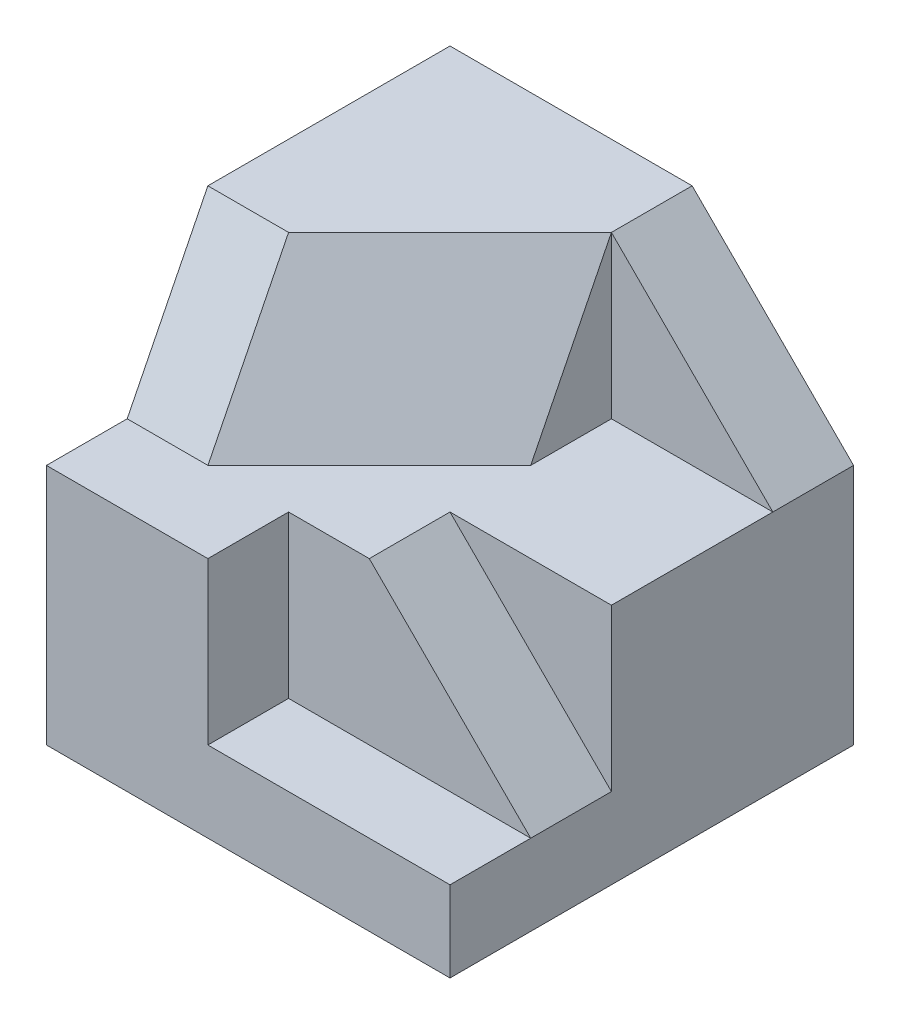
ISO-10303-21;
HEADER;
FILE_DESCRIPTION(('STEP AP214'),'2;1');
FILE_NAME('part.step','',(''),(''),'','','');
FILE_SCHEMA(('AUTOMOTIVE_DESIGN { 1 0 10303 214 1 1 1 1 }'));
ENDSEC;
DATA;
#1=APPLICATION_CONTEXT('core data for automotive mechanical design processes');
#2=APPLICATION_PROTOCOL_DEFINITION('international standard','automotive_design',2000,#1);
#3=PRODUCT_CONTEXT('',#1,'mechanical');
#4=PRODUCT('Part','Part','',(#3));
#5=PRODUCT_RELATED_PRODUCT_CATEGORY('part','',(#4));
#6=PRODUCT_DEFINITION_FORMATION('','',#4);
#7=PRODUCT_DEFINITION_CONTEXT('part definition',#1,'design');
#8=PRODUCT_DEFINITION('design','',#6,#7);
#9=PRODUCT_DEFINITION_SHAPE('','',#8);
#10=(LENGTH_UNIT() NAMED_UNIT(*) SI_UNIT(.MILLI.,.METRE.));
#11=(NAMED_UNIT(*) PLANE_ANGLE_UNIT() SI_UNIT($,.RADIAN.));
#12=(NAMED_UNIT(*) SI_UNIT($,.STERADIAN.) SOLID_ANGLE_UNIT());
#13=UNCERTAINTY_MEASURE_WITH_UNIT(LENGTH_MEASURE(1.E-05),#10,'distance_accuracy_value','');
#14=(GEOMETRIC_REPRESENTATION_CONTEXT(3) GLOBAL_UNCERTAINTY_ASSIGNED_CONTEXT((#13)) GLOBAL_UNIT_ASSIGNED_CONTEXT((#10,
#11,#12)) REPRESENTATION_CONTEXT('',''));
#15=CARTESIAN_POINT('',(0.,0.,0.));
#16=DIRECTION('',(0.,0.,1.));
#17=DIRECTION('',(1.,0.,0.));
#18=AXIS2_PLACEMENT_3D('',#15,#16,#17);
#19=CARTESIAN_POINT('',(-2.5,2.5,3.));
#20=DIRECTION('',(0.,-0.447036349590366,-0.89451579200421));
#21=DIRECTION('',(0.,0.89451579200421,-0.447036349590367));
#22=AXIS2_PLACEMENT_3D('',#19,#20,#21);
#23=PLANE('',#22);
#24=DIRECTION('',(-0.408197700208268,-0.816597698810937,0.408096601114692));
#25=VECTOR('',#24,1.);
#26=CARTESIAN_POINT('',(-0.833457179510442,1.83341597243937,3.33312691965817));
#27=LINE('',#26,#25);
#28=CARTESIAN_POINT('',(-1.49950490153612,0.500990442293238,3.9990096803895));
#29=VERTEX_POINT('',#28);
#30=CARTESIAN_POINT('',(-1.5,0.5,3.99950465623141));
#31=VERTEX_POINT('',#30);
#32=EDGE_CURVE('E124',#29,#31,#27,.T.);
#33=ORIENTED_EDGE('',*,*,#32,.F.);
#34=DIRECTION('',(-0.000221546406301295,0.894515770051536,-0.447036338619466));
#35=VECTOR('',#34,1.);
#36=CARTESIAN_POINT('',(-1.50000004908281,2.50019817675423,2.99990096070569));
#37=LINE('',#36,#35);
#38=CARTESIAN_POINT('',(-1.5,2.5,3.));
#39=VERTEX_POINT('',#38);
#40=EDGE_CURVE('E130',#29,#39,#37,.T.);
#41=ORIENTED_EDGE('',*,*,#40,.T.);
#42=DIRECTION('',(1.,0.,0.));
#43=VECTOR('',#42,1.);
#44=CARTESIAN_POINT('',(-2.5,2.5,3.));
#45=LINE('',#44,#43);
#46=CARTESIAN_POINT('',(-2.5,2.5,3.));
#47=VERTEX_POINT('',#46);
#48=EDGE_CURVE('E162',#47,#39,#45,.T.);
#49=ORIENTED_EDGE('',*,*,#48,.F.);
#50=DIRECTION('',(0.,0.89451579200421,-0.447036349590367));
#51=VECTOR('',#50,1.);
#52=CARTESIAN_POINT('',(-2.5,2.5,3.));
#53=LINE('',#52,#51);
#54=CARTESIAN_POINT('',(-2.5,0.5,3.99950465623141));
#55=VERTEX_POINT('',#54);
#56=EDGE_CURVE('E142',#55,#47,#53,.T.);
#57=ORIENTED_EDGE('',*,*,#56,.F.);
#58=DIRECTION('',(-1.,0.,0.));
#59=VECTOR('',#58,1.);
#60=CARTESIAN_POINT('',(-0.499999999999999,0.5,3.99950465623141));
#61=LINE('',#60,#59);
#62=EDGE_CURVE('E135',#31,#55,#61,.T.);
#63=ORIENTED_EDGE('',*,*,#62,.F.);
#64=EDGE_LOOP('',(#33,#41,#49,#57,#63));
#65=FACE_BOUND('',#64,.T.);
#66=ADVANCED_FACE('F33',(#65),#23,.F.);
#67=CARTESIAN_POINT('',(1.22222222222222,0.611111111111111,1.22222222222222));
#68=DIRECTION('',(-0.666666666666666,-0.333333333333333,-0.666666666666667));
#69=DIRECTION('',(-0.707106781186548,0.,0.707106781186547));
#70=AXIS2_PLACEMENT_3D('',#67,#68,#69);
#71=PLANE('',#70);
#72=DIRECTION('',(-0.707194308451179,0.000350304293873403,0.707019156304241));
#73=VECTOR('',#72,1.);
#74=CARTESIAN_POINT('',(1.25006181825718,0.499628461552267,1.25012395096668));
#75=LINE('',#74,#73);
#76=CARTESIAN_POINT('',(0.500000000000001,0.499999999999999,2.));
#77=VERTEX_POINT('',#76);
#78=EDGE_CURVE('E126',#77,#29,#75,.T.);
#79=ORIENTED_EDGE('',*,*,#78,.F.);
#80=DIRECTION('',(0.,0.894427190999916,-0.447213595499958));
#81=VECTOR('',#80,1.);
#82=CARTESIAN_POINT('',(0.500000000000001,0.499999999999999,2.));
#83=LINE('',#82,#81);
#84=CARTESIAN_POINT('',(0.500000000000001,2.5,1.));
#85=VERTEX_POINT('',#84);
#86=EDGE_CURVE('E37',#77,#85,#83,.T.);
#87=ORIENTED_EDGE('',*,*,#86,.T.);
#88=DIRECTION('',(-0.707106781186548,0.,0.707106781186547));
#89=VECTOR('',#88,1.);
#90=CARTESIAN_POINT('',(0.500000000000001,2.5,1.));
#91=LINE('',#90,#89);
#92=EDGE_CURVE('E11',#85,#39,#91,.T.);
#93=ORIENTED_EDGE('',*,*,#92,.T.);
#94=ORIENTED_EDGE('',*,*,#40,.F.);
#95=EDGE_LOOP('',(#79,#87,#93,#94));
#96=FACE_BOUND('',#95,.T.);
#97=ADVANCED_FACE('F239',(#96),#71,.F.);
#98=CARTESIAN_POINT('',(0.,0.5,0.));
#99=DIRECTION('',(0.,1.,0.));
#100=DIRECTION('',(0.,0.,1.));
#101=AXIS2_PLACEMENT_3D('',#98,#99,#100);
#102=PLANE('',#101);
#103=DIRECTION('',(0.,0.,1.));
#104=VECTOR('',#103,1.);
#105=CARTESIAN_POINT('',(0.500000000000001,0.5,1.));
#106=LINE('',#105,#104);
#107=CARTESIAN_POINT('',(0.500000000000001,0.5,1.));
#108=VERTEX_POINT('',#107);
#109=EDGE_CURVE('E139',#108,#77,#106,.T.);
#110=ORIENTED_EDGE('',*,*,#109,.T.);
#111=DIRECTION('',(-0.707194351842185,0.,0.707019199684501));
#112=VECTOR('',#111,1.);
#113=CARTESIAN_POINT('',(0.500000000000001,0.5,2.));
#114=LINE('',#113,#112);
#115=EDGE_CURVE('E49',#77,#31,#114,.T.);
#116=ORIENTED_EDGE('',*,*,#115,.T.);
#117=ORIENTED_EDGE('',*,*,#62,.T.);
#118=DIRECTION('',(0.,0.,1.));
#119=VECTOR('',#118,1.);
#120=CARTESIAN_POINT('',(-2.5,0.5,5.));
#121=LINE('',#120,#119);
#122=CARTESIAN_POINT('',(-2.5,0.5,5.));
#123=VERTEX_POINT('',#122);
#124=EDGE_CURVE('E144',#55,#123,#121,.T.);
#125=ORIENTED_EDGE('',*,*,#124,.T.);
#126=DIRECTION('',(1.,0.,0.));
#127=VECTOR('',#126,1.);
#128=CARTESIAN_POINT('',(-2.5,0.5,5.));
#129=LINE('',#128,#127);
#130=CARTESIAN_POINT('',(-0.5,0.5,5.));
#131=VERTEX_POINT('',#130);
#132=EDGE_CURVE('E147',#123,#131,#129,.T.);
#133=ORIENTED_EDGE('',*,*,#132,.T.);
#134=DIRECTION('',(0.,0.,1.));
#135=VECTOR('',#134,1.);
#136=CARTESIAN_POINT('',(-0.5,0.5,4.));
#137=LINE('',#136,#135);
#138=CARTESIAN_POINT('',(-0.5,0.5,4.));
#139=VERTEX_POINT('',#138);
#140=EDGE_CURVE('E181',#139,#131,#137,.T.);
#141=ORIENTED_EDGE('',*,*,#140,.F.);
#142=DIRECTION('',(-1.,0.,0.));
#143=VECTOR('',#142,1.);
#144=CARTESIAN_POINT('',(2.5,0.5,4.));
#145=LINE('',#144,#143);
#146=CARTESIAN_POINT('',(0.500000000000002,0.5,4.));
#147=VERTEX_POINT('',#146);
#148=EDGE_CURVE('E183',#147,#139,#145,.T.);
#149=ORIENTED_EDGE('',*,*,#148,.F.);
#150=DIRECTION('',(0.,0.,1.));
#151=VECTOR('',#150,1.);
#152=CARTESIAN_POINT('',(0.500000000000001,0.5,3.));
#153=LINE('',#152,#151);
#154=CARTESIAN_POINT('',(0.500000000000001,0.5,3.));
#155=VERTEX_POINT('',#154);
#156=EDGE_CURVE('E203',#155,#147,#153,.T.);
#157=ORIENTED_EDGE('',*,*,#156,.F.);
#158=DIRECTION('',(-1.,0.,0.));
#159=VECTOR('',#158,1.);
#160=CARTESIAN_POINT('',(2.5,0.5,3.));
#161=LINE('',#160,#159);
#162=CARTESIAN_POINT('',(2.5,0.5,3.));
#163=VERTEX_POINT('',#162);
#164=EDGE_CURVE('E213',#163,#155,#161,.T.);
#165=ORIENTED_EDGE('',*,*,#164,.F.);
#166=DIRECTION('',(0.,0.,-1.));
#167=VECTOR('',#166,1.);
#168=CARTESIAN_POINT('',(2.5,0.5,5.));
#169=LINE('',#168,#167);
#170=CARTESIAN_POINT('',(2.5,0.5,1.));
#171=VERTEX_POINT('',#170);
#172=EDGE_CURVE('E154',#163,#171,#169,.T.);
#173=ORIENTED_EDGE('',*,*,#172,.T.);
#174=DIRECTION('',(-1.,0.,0.));
#175=VECTOR('',#174,1.);
#176=CARTESIAN_POINT('',(2.5,0.5,1.));
#177=LINE('',#176,#175);
#178=EDGE_CURVE('E155',#171,#108,#177,.T.);
#179=ORIENTED_EDGE('',*,*,#178,.T.);
#180=EDGE_LOOP('',(#110,#116,#117,#125,#133,#141,#149,#157,#165,#173,#179));
#181=FACE_BOUND('',#180,.T.);
#182=ADVANCED_FACE('F134',(#181),#102,.T.);
#183=CARTESIAN_POINT('',(0.,0.,5.));
#184=DIRECTION('',(0.,0.,1.));
#185=DIRECTION('',(1.,0.,0.));
#186=AXIS2_PLACEMENT_3D('',#183,#184,#185);
#187=PLANE('',#186);
#188=DIRECTION('',(1.,0.,0.));
#189=VECTOR('',#188,1.);
#190=CARTESIAN_POINT('',(-0.499999999999999,-1.5,5.));
#191=LINE('',#190,#189);
#192=CARTESIAN_POINT('',(-0.499999999999999,-1.5,5.));
#193=VERTEX_POINT('',#192);
#194=CARTESIAN_POINT('',(2.5,-1.5,5.));
#195=VERTEX_POINT('',#194);
#196=EDGE_CURVE('E180',#193,#195,#191,.T.);
#197=ORIENTED_EDGE('',*,*,#196,.F.);
#198=DIRECTION('',(0.,-1.,0.));
#199=VECTOR('',#198,1.);
#200=CARTESIAN_POINT('',(-0.5,0.5,5.));
#201=LINE('',#200,#199);
#202=EDGE_CURVE('E184',#131,#193,#201,.T.);
#203=ORIENTED_EDGE('',*,*,#202,.F.);
#204=ORIENTED_EDGE('',*,*,#132,.F.);
#205=DIRECTION('',(0.,-1.,0.));
#206=VECTOR('',#205,1.);
#207=CARTESIAN_POINT('',(-2.5,-2.5,5.));
#208=LINE('',#207,#206);
#209=CARTESIAN_POINT('',(-2.5,-2.5,5.));
#210=VERTEX_POINT('',#209);
#211=EDGE_CURVE('E157',#123,#210,#208,.T.);
#212=ORIENTED_EDGE('',*,*,#211,.T.);
#213=DIRECTION('',(1.,0.,0.));
#214=VECTOR('',#213,1.);
#215=CARTESIAN_POINT('',(2.5,-2.5,5.));
#216=LINE('',#215,#214);
#217=CARTESIAN_POINT('',(2.5,-2.5,5.));
#218=VERTEX_POINT('',#217);
#219=EDGE_CURVE('E261',#210,#218,#216,.T.);
#220=ORIENTED_EDGE('',*,*,#219,.T.);
#221=DIRECTION('',(0.,1.,0.));
#222=VECTOR('',#221,1.);
#223=CARTESIAN_POINT('',(2.5,-2.5,5.));
#224=LINE('',#223,#222);
#225=EDGE_CURVE('E169',#218,#195,#224,.T.);
#226=ORIENTED_EDGE('',*,*,#225,.T.);
#227=EDGE_LOOP('',(#197,#203,#204,#212,#220,#226));
#228=FACE_BOUND('',#227,.T.);
#229=ADVANCED_FACE('F268',(#228),#187,.T.);
#230=CARTESIAN_POINT('',(-2.5,-2.5,5.));
#231=DIRECTION('',(1.,0.,0.));
#232=DIRECTION('',(0.,0.,-1.));
#233=AXIS2_PLACEMENT_3D('',#230,#231,#232);
#234=PLANE('',#233);
#235=ORIENTED_EDGE('',*,*,#124,.F.);
#236=ORIENTED_EDGE('',*,*,#56,.T.);
#237=DIRECTION('',(0.,0.,-1.));
#238=VECTOR('',#237,1.);
#239=CARTESIAN_POINT('',(-2.5,2.5,5.));
#240=LINE('',#239,#238);
#241=CARTESIAN_POINT('',(-2.5,2.5,0.));
#242=VERTEX_POINT('',#241);
#243=EDGE_CURVE('E168',#47,#242,#240,.T.);
#244=ORIENTED_EDGE('',*,*,#243,.T.);
#245=DIRECTION('',(0.,-1.,0.));
#246=VECTOR('',#245,1.);
#247=CARTESIAN_POINT('',(-2.5,-2.5,0.));
#248=LINE('',#247,#246);
#249=CARTESIAN_POINT('',(-2.5,-2.5,0.));
#250=VERTEX_POINT('',#249);
#251=EDGE_CURVE('E249',#242,#250,#248,.T.);
#252=ORIENTED_EDGE('',*,*,#251,.T.);
#253=DIRECTION('',(0.,0.,-1.));
#254=VECTOR('',#253,1.);
#255=CARTESIAN_POINT('',(-2.5,-2.5,5.));
#256=LINE('',#255,#254);
#257=EDGE_CURVE('E208',#210,#250,#256,.T.);
#258=ORIENTED_EDGE('',*,*,#257,.F.);
#259=ORIENTED_EDGE('',*,*,#211,.F.);
#260=EDGE_LOOP('',(#235,#236,#244,#252,#258,#259));
#261=FACE_BOUND('',#260,.T.);
#262=ADVANCED_FACE('F277',(#261),#234,.F.);
#263=CARTESIAN_POINT('',(2.5,-2.5,5.));
#264=DIRECTION('',(0.,1.,0.));
#265=DIRECTION('',(-1.,0.,0.));
#266=AXIS2_PLACEMENT_3D('',#263,#264,#265);
#267=PLANE('',#266);
#268=DIRECTION('',(1.,0.,0.));
#269=VECTOR('',#268,1.);
#270=CARTESIAN_POINT('',(2.5,-2.5,0.));
#271=LINE('',#270,#269);
#272=CARTESIAN_POINT('',(2.5,-2.5,0.));
#273=VERTEX_POINT('',#272);
#274=EDGE_CURVE('E256',#250,#273,#271,.T.);
#275=ORIENTED_EDGE('',*,*,#274,.T.);
#276=DIRECTION('',(0.,0.,-1.));
#277=VECTOR('',#276,1.);
#278=CARTESIAN_POINT('',(2.5,-2.5,5.));
#279=LINE('',#278,#277);
#280=EDGE_CURVE('E190',#218,#273,#279,.T.);
#281=ORIENTED_EDGE('',*,*,#280,.F.);
#282=ORIENTED_EDGE('',*,*,#219,.F.);
#283=ORIENTED_EDGE('',*,*,#257,.T.);
#284=EDGE_LOOP('',(#275,#281,#282,#283));
#285=FACE_BOUND('',#284,.T.);
#286=ADVANCED_FACE('F275',(#285),#267,.F.);
#287=CARTESIAN_POINT('',(2.5,-2.5,5.));
#288=DIRECTION('',(-1.,0.,0.));
#289=DIRECTION('',(0.,0.,1.));
#290=AXIS2_PLACEMENT_3D('',#287,#288,#289);
#291=PLANE('',#290);
#292=DIRECTION('',(0.,1.,0.));
#293=VECTOR('',#292,1.);
#294=CARTESIAN_POINT('',(2.5,-1.5,3.));
#295=LINE('',#294,#293);
#296=CARTESIAN_POINT('',(2.5,-1.5,3.));
#297=VERTEX_POINT('',#296);
#298=EDGE_CURVE('E205',#297,#163,#295,.T.);
#299=ORIENTED_EDGE('',*,*,#298,.F.);
#300=DIRECTION('',(0.,0.,1.));
#301=VECTOR('',#300,1.);
#302=CARTESIAN_POINT('',(2.5,-1.5,3.));
#303=LINE('',#302,#301);
#304=CARTESIAN_POINT('',(2.5,-1.5,4.));
#305=VERTEX_POINT('',#304);
#306=EDGE_CURVE('E191',#297,#305,#303,.T.);
#307=ORIENTED_EDGE('',*,*,#306,.T.);
#308=DIRECTION('',(0.,0.,1.));
#309=VECTOR('',#308,1.);
#310=CARTESIAN_POINT('',(2.5,-1.5,4.));
#311=LINE('',#310,#309);
#312=EDGE_CURVE('E187',#305,#195,#311,.T.);
#313=ORIENTED_EDGE('',*,*,#312,.T.);
#314=ORIENTED_EDGE('',*,*,#225,.F.);
#315=ORIENTED_EDGE('',*,*,#280,.T.);
#316=DIRECTION('',(0.,1.,0.));
#317=VECTOR('',#316,1.);
#318=CARTESIAN_POINT('',(2.5,-2.5,0.));
#319=LINE('',#318,#317);
#320=CARTESIAN_POINT('',(2.5,0.5,0.));
#321=VERTEX_POINT('',#320);
#322=EDGE_CURVE('E177',#273,#321,#319,.T.);
#323=ORIENTED_EDGE('',*,*,#322,.T.);
#324=DIRECTION('',(0.,0.,1.));
#325=VECTOR('',#324,1.);
#326=CARTESIAN_POINT('',(2.5,0.5,-1.));
#327=LINE('',#326,#325);
#328=EDGE_CURVE('E166',#321,#171,#327,.T.);
#329=ORIENTED_EDGE('',*,*,#328,.T.);
#330=ORIENTED_EDGE('',*,*,#172,.F.);
#331=EDGE_LOOP('',(#299,#307,#313,#314,#315,#323,#329,#330));
#332=FACE_BOUND('',#331,.T.);
#333=ADVANCED_FACE('F224',(#332),#291,.F.);
#334=CARTESIAN_POINT('',(2.5,2.5,5.));
#335=DIRECTION('',(0.,-1.,0.));
#336=DIRECTION('',(0.,0.,-1.));
#337=AXIS2_PLACEMENT_3D('',#334,#335,#336);
#338=PLANE('',#337);
#339=ORIENTED_EDGE('',*,*,#48,.T.);
#340=ORIENTED_EDGE('',*,*,#92,.F.);
#341=DIRECTION('',(0.,0.,1.));
#342=VECTOR('',#341,1.);
#343=CARTESIAN_POINT('',(0.500000000000001,2.5,-1.));
#344=LINE('',#343,#342);
#345=CARTESIAN_POINT('',(0.500000000000001,2.5,0.));
#346=VERTEX_POINT('',#345);
#347=EDGE_CURVE('E161',#346,#85,#344,.T.);
#348=ORIENTED_EDGE('',*,*,#347,.F.);
#349=DIRECTION('',(-1.,0.,0.));
#350=VECTOR('',#349,1.);
#351=CARTESIAN_POINT('',(2.5,2.5,0.));
#352=LINE('',#351,#350);
#353=EDGE_CURVE('E165',#346,#242,#352,.T.);
#354=ORIENTED_EDGE('',*,*,#353,.T.);
#355=ORIENTED_EDGE('',*,*,#243,.F.);
#356=EDGE_LOOP('',(#339,#340,#348,#354,#355));
#357=FACE_BOUND('',#356,.T.);
#358=ADVANCED_FACE('F35',(#357),#338,.F.);
#359=CARTESIAN_POINT('',(0.,0.,0.));
#360=DIRECTION('',(0.,0.,1.));
#361=DIRECTION('',(1.,0.,0.));
#362=AXIS2_PLACEMENT_3D('',#359,#360,#361);
#363=PLANE('',#362);
#364=ORIENTED_EDGE('',*,*,#353,.F.);
#365=DIRECTION('',(0.707106781186548,-0.707106781186548,0.));
#366=VECTOR('',#365,1.);
#367=CARTESIAN_POINT('',(1.5,1.5,0.));
#368=LINE('',#367,#366);
#369=EDGE_CURVE('E150',#346,#321,#368,.T.);
#370=ORIENTED_EDGE('',*,*,#369,.T.);
#371=ORIENTED_EDGE('',*,*,#322,.F.);
#372=ORIENTED_EDGE('',*,*,#274,.F.);
#373=ORIENTED_EDGE('',*,*,#251,.F.);
#374=EDGE_LOOP('',(#364,#370,#371,#372,#373));
#375=FACE_BOUND('',#374,.T.);
#376=ADVANCED_FACE('F246',(#375),#363,.F.);
#377=CARTESIAN_POINT('',(0.500000000000001,0.5,1.));
#378=DIRECTION('',(-1.,0.,0.));
#379=DIRECTION('',(0.,0.,1.));
#380=AXIS2_PLACEMENT_3D('',#377,#378,#379);
#381=PLANE('',#380);
#382=DIRECTION('',(0.,1.,0.));
#383=VECTOR('',#382,1.);
#384=CARTESIAN_POINT('',(0.500000000000001,0.5,1.));
#385=LINE('',#384,#383);
#386=EDGE_CURVE('E145',#108,#85,#385,.T.);
#387=ORIENTED_EDGE('',*,*,#386,.T.);
#388=ORIENTED_EDGE('',*,*,#86,.F.);
#389=ORIENTED_EDGE('',*,*,#109,.F.);
#390=EDGE_LOOP('',(#387,#388,#389));
#391=FACE_BOUND('',#390,.T.);
#392=ADVANCED_FACE('F235',(#391),#381,.F.);
#393=CARTESIAN_POINT('',(2.5,0.5,1.));
#394=DIRECTION('',(0.,0.,-1.));
#395=DIRECTION('',(-1.,0.,0.));
#396=AXIS2_PLACEMENT_3D('',#393,#394,#395);
#397=PLANE('',#396);
#398=ORIENTED_EDGE('',*,*,#178,.F.);
#399=DIRECTION('',(0.707106781186548,-0.707106781186548,0.));
#400=VECTOR('',#399,1.);
#401=CARTESIAN_POINT('',(0.500000000000001,2.5,1.));
#402=LINE('',#401,#400);
#403=EDGE_CURVE('E174',#85,#171,#402,.T.);
#404=ORIENTED_EDGE('',*,*,#403,.F.);
#405=ORIENTED_EDGE('',*,*,#386,.F.);
#406=EDGE_LOOP('',(#398,#404,#405));
#407=FACE_BOUND('',#406,.T.);
#408=ADVANCED_FACE('F232',(#407),#397,.F.);
#409=CARTESIAN_POINT('',(0.500000000000001,2.5,-1.));
#410=DIRECTION('',(-0.707106781186547,-0.707106781186547,0.));
#411=DIRECTION('',(0.707106781186548,-0.707106781186548,0.));
#412=AXIS2_PLACEMENT_3D('',#409,#410,#411);
#413=PLANE('',#412);
#414=ORIENTED_EDGE('',*,*,#347,.T.);
#415=ORIENTED_EDGE('',*,*,#403,.T.);
#416=ORIENTED_EDGE('',*,*,#328,.F.);
#417=ORIENTED_EDGE('',*,*,#369,.F.);
#418=EDGE_LOOP('',(#414,#415,#416,#417));
#419=FACE_BOUND('',#418,.T.);
#420=ADVANCED_FACE('F244',(#419),#413,.F.);
#421=CARTESIAN_POINT('',(-0.499999999999999,-1.5,4.));
#422=DIRECTION('',(0.,-1.,0.));
#423=DIRECTION('',(0.,0.,-1.));
#424=AXIS2_PLACEMENT_3D('',#421,#422,#423);
#425=PLANE('',#424);
#426=ORIENTED_EDGE('',*,*,#196,.T.);
#427=ORIENTED_EDGE('',*,*,#312,.F.);
#428=DIRECTION('',(1.,0.,0.));
#429=VECTOR('',#428,1.);
#430=CARTESIAN_POINT('',(-0.499999999999999,-1.5,4.));
#431=LINE('',#430,#429);
#432=CARTESIAN_POINT('',(-0.499999999999999,-1.5,4.));
#433=VERTEX_POINT('',#432);
#434=EDGE_CURVE('E195',#433,#305,#431,.T.);
#435=ORIENTED_EDGE('',*,*,#434,.F.);
#436=DIRECTION('',(0.,0.,1.));
#437=VECTOR('',#436,1.);
#438=CARTESIAN_POINT('',(-0.499999999999999,-1.5,4.));
#439=LINE('',#438,#437);
#440=EDGE_CURVE('E185',#433,#193,#439,.T.);
#441=ORIENTED_EDGE('',*,*,#440,.T.);
#442=EDGE_LOOP('',(#426,#427,#435,#441));
#443=FACE_BOUND('',#442,.T.);
#444=ADVANCED_FACE('F282',(#443),#425,.F.);
#445=CARTESIAN_POINT('',(-0.5,0.5,4.));
#446=DIRECTION('',(-1.,0.,0.));
#447=DIRECTION('',(0.,-1.,0.));
#448=AXIS2_PLACEMENT_3D('',#445,#446,#447);
#449=PLANE('',#448);
#450=ORIENTED_EDGE('',*,*,#202,.T.);
#451=ORIENTED_EDGE('',*,*,#440,.F.);
#452=DIRECTION('',(0.,-1.,0.));
#453=VECTOR('',#452,1.);
#454=CARTESIAN_POINT('',(-0.5,0.5,4.));
#455=LINE('',#454,#453);
#456=EDGE_CURVE('E199',#139,#433,#455,.T.);
#457=ORIENTED_EDGE('',*,*,#456,.F.);
#458=ORIENTED_EDGE('',*,*,#140,.T.);
#459=EDGE_LOOP('',(#450,#451,#457,#458));
#460=FACE_BOUND('',#459,.T.);
#461=ADVANCED_FACE('F286',(#460),#449,.F.);
#462=CARTESIAN_POINT('',(0.,0.,4.));
#463=DIRECTION('',(0.,0.,1.));
#464=DIRECTION('',(1.,0.,0.));
#465=AXIS2_PLACEMENT_3D('',#462,#463,#464);
#466=PLANE('',#465);
#467=DIRECTION('',(0.707106781186548,-0.707106781186548,0.));
#468=VECTOR('',#467,1.);
#469=CARTESIAN_POINT('',(0.500000000000001,0.5,4.));
#470=LINE('',#469,#468);
#471=EDGE_CURVE('E198',#147,#305,#470,.T.);
#472=ORIENTED_EDGE('',*,*,#471,.F.);
#473=ORIENTED_EDGE('',*,*,#148,.T.);
#474=ORIENTED_EDGE('',*,*,#456,.T.);
#475=ORIENTED_EDGE('',*,*,#434,.T.);
#476=EDGE_LOOP('',(#472,#473,#474,#475));
#477=FACE_BOUND('',#476,.T.);
#478=ADVANCED_FACE('F290',(#477),#466,.T.);
#479=CARTESIAN_POINT('',(0.500000000000001,0.5,3.));
#480=DIRECTION('',(-0.707106781186547,-0.707106781186547,0.));
#481=DIRECTION('',(0.707106781186548,-0.707106781186548,0.));
#482=AXIS2_PLACEMENT_3D('',#479,#480,#481);
#483=PLANE('',#482);
#484=ORIENTED_EDGE('',*,*,#471,.T.);
#485=ORIENTED_EDGE('',*,*,#306,.F.);
#486=DIRECTION('',(0.707106781186548,-0.707106781186548,0.));
#487=VECTOR('',#486,1.);
#488=CARTESIAN_POINT('',(0.500000000000001,0.5,3.));
#489=LINE('',#488,#487);
#490=EDGE_CURVE('E210',#155,#297,#489,.T.);
#491=ORIENTED_EDGE('',*,*,#490,.F.);
#492=ORIENTED_EDGE('',*,*,#156,.T.);
#493=EDGE_LOOP('',(#484,#485,#491,#492));
#494=FACE_BOUND('',#493,.T.);
#495=ADVANCED_FACE('F292',(#494),#483,.F.);
#496=CARTESIAN_POINT('',(0.,0.,3.));
#497=DIRECTION('',(0.,0.,1.));
#498=DIRECTION('',(1.,0.,0.));
#499=AXIS2_PLACEMENT_3D('',#496,#497,#498);
#500=PLANE('',#499);
#501=ORIENTED_EDGE('',*,*,#298,.T.);
#502=ORIENTED_EDGE('',*,*,#164,.T.);
#503=ORIENTED_EDGE('',*,*,#490,.T.);
#504=EDGE_LOOP('',(#501,#502,#503));
#505=FACE_BOUND('',#504,.T.);
#506=ADVANCED_FACE('F218',(#505),#500,.T.);
#507=CARTESIAN_POINT('',(0.500000000000001,2.5,2.));
#508=DIRECTION('',(0.707019199684501,0.,0.707194351842185));
#509=DIRECTION('',(0.707194351842185,0.,-0.707019199684501));
#510=AXIS2_PLACEMENT_3D('',#507,#508,#509);
#511=PLANE('',#510);
#512=ORIENTED_EDGE('',*,*,#32,.T.);
#513=ORIENTED_EDGE('',*,*,#115,.F.);
#514=ORIENTED_EDGE('',*,*,#78,.T.);
#515=EDGE_LOOP('',(#512,#513,#514));
#516=FACE_BOUND('',#515,.T.);
#517=ADVANCED_FACE('F125',(#516),#511,.T.);
#518=CLOSED_SHELL('',(#66,#97,#182,#229,#262,#286,#333,#358,#376,#392,#408,#420,#444,#461,#478,
#495,#506,#517));
#519=MANIFOLD_SOLID_BREP('B2',#518);
#520=ADVANCED_BREP_SHAPE_REPRESENTATION('',(#18,#519),#14);
#521=SHAPE_DEFINITION_REPRESENTATION(#9,#520);
ENDSEC;
END-ISO-10303-21;
